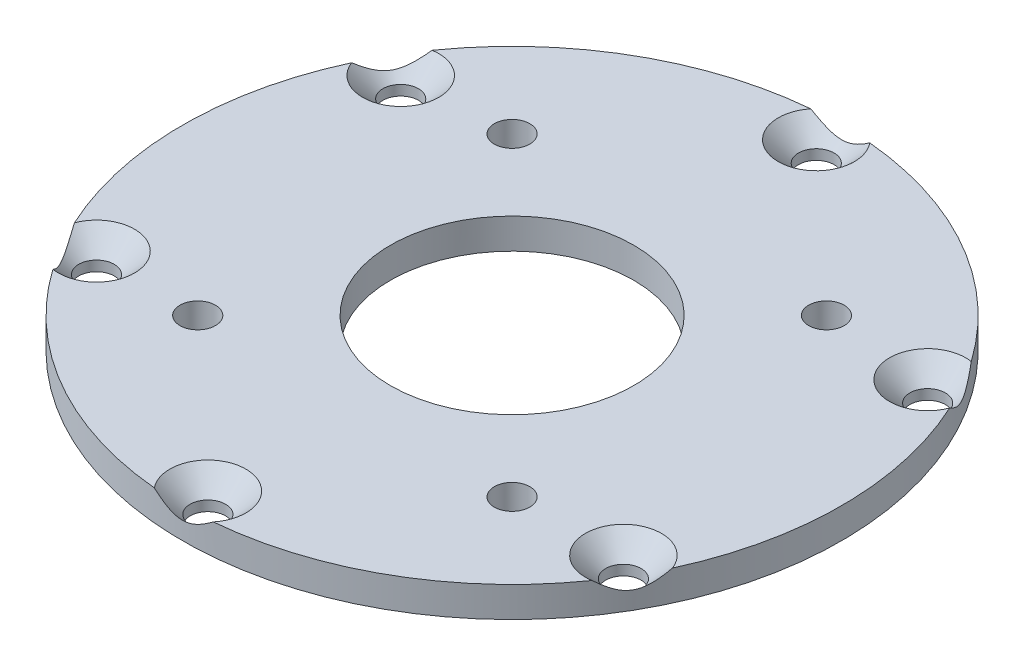
ISO-10303-21;
HEADER;
FILE_DESCRIPTION(('STEP AP214'),'2;1');
FILE_NAME('part.step','',(''),(''),'','','');
FILE_SCHEMA(('AUTOMOTIVE_DESIGN { 1 0 10303 214 1 1 1 1 }'));
ENDSEC;
DATA;
#1=APPLICATION_CONTEXT('core data for automotive mechanical design processes');
#2=APPLICATION_PROTOCOL_DEFINITION('international standard','automotive_design',2000,#1);
#3=PRODUCT_CONTEXT('',#1,'mechanical');
#4=PRODUCT('Part','Part','',(#3));
#5=PRODUCT_RELATED_PRODUCT_CATEGORY('part','',(#4));
#6=PRODUCT_DEFINITION_FORMATION('','',#4);
#7=PRODUCT_DEFINITION_CONTEXT('part definition',#1,'design');
#8=PRODUCT_DEFINITION('design','',#6,#7);
#9=PRODUCT_DEFINITION_SHAPE('','',#8);
#10=(LENGTH_UNIT() NAMED_UNIT(*) SI_UNIT(.MILLI.,.METRE.));
#11=(NAMED_UNIT(*) PLANE_ANGLE_UNIT() SI_UNIT($,.RADIAN.));
#12=(NAMED_UNIT(*) SI_UNIT($,.STERADIAN.) SOLID_ANGLE_UNIT());
#13=UNCERTAINTY_MEASURE_WITH_UNIT(LENGTH_MEASURE(1.E-05),#10,'distance_accuracy_value','');
#14=(GEOMETRIC_REPRESENTATION_CONTEXT(3) GLOBAL_UNCERTAINTY_ASSIGNED_CONTEXT((#13)) GLOBAL_UNIT_ASSIGNED_CONTEXT((#10,
#11,#12)) REPRESENTATION_CONTEXT('',''));
#15=CARTESIAN_POINT('',(0.,0.,0.));
#16=DIRECTION('',(0.,0.,1.));
#17=DIRECTION('',(1.,0.,0.));
#18=AXIS2_PLACEMENT_3D('',#15,#16,#17);
#19=CARTESIAN_POINT('',(0.,2.,0.));
#20=DIRECTION('',(0.,1.,0.));
#21=DIRECTION('',(0.,0.,1.));
#22=AXIS2_PLACEMENT_3D('',#19,#20,#21);
#23=PLANE('',#22);
#24=CARTESIAN_POINT('',(15.5,2.,15.5));
#25=DIRECTION('',(0.,1.,0.));
#26=DIRECTION('',(0.,0.,1.));
#27=AXIS2_PLACEMENT_3D('',#24,#25,#26);
#28=CIRCLE('',#27,1.75);
#29=CARTESIAN_POINT('',(15.5,2.,17.25));
#30=VERTEX_POINT('',#29);
#31=EDGE_CURVE('E152',#30,#30,#28,.T.);
#32=ORIENTED_EDGE('',*,*,#31,.F.);
#33=EDGE_LOOP('',(#32));
#34=FACE_BOUND('',#33,.T.);
#35=CARTESIAN_POINT('',(-15.5,2.,-15.5));
#36=DIRECTION('',(0.,1.,0.));
#37=DIRECTION('',(0.,0.,1.));
#38=AXIS2_PLACEMENT_3D('',#35,#36,#37);
#39=CIRCLE('',#38,1.75);
#40=CARTESIAN_POINT('',(-15.5,2.,-13.75));
#41=VERTEX_POINT('',#40);
#42=EDGE_CURVE('E125',#41,#41,#39,.T.);
#43=ORIENTED_EDGE('',*,*,#42,.F.);
#44=EDGE_LOOP('',(#43));
#45=FACE_BOUND('',#44,.T.);
#46=CARTESIAN_POINT('',(0.,2.,0.));
#47=DIRECTION('',(0.,1.,0.));
#48=DIRECTION('',(0.,0.,1.));
#49=AXIS2_PLACEMENT_3D('',#46,#47,#48);
#50=CIRCLE('',#49,32.5);
#51=CARTESIAN_POINT('',(2.90630133616557,2.,32.3697916666667));
#52=VERTEX_POINT('',#51);
#53=CARTESIAN_POINT('',(26.5799112304604,2.,18.7018266215053));
#54=VERTEX_POINT('',#53);
#55=EDGE_CURVE('E102',#52,#54,#50,.T.);
#56=ORIENTED_EDGE('',*,*,#55,.T.);
#57=CARTESIAN_POINT('',(25.9807621135332,2.,15.));
#58=DIRECTION('',(0.,1.,0.));
#59=DIRECTION('',(0.,0.,1.));
#60=AXIS2_PLACEMENT_3D('',#57,#58,#59);
#61=CIRCLE('',#60,3.75000000000003);
#62=CARTESIAN_POINT('',(29.4862125666259,2.,13.6679650451613));
#63=VERTEX_POINT('',#62);
#64=EDGE_CURVE('E284',#54,#63,#61,.F.);
#65=ORIENTED_EDGE('',*,*,#64,.T.);
#66=CARTESIAN_POINT('',(29.4862125666259,2.,-13.6679650451614));
#67=VERTEX_POINT('',#66);
#68=EDGE_CURVE('E112',#63,#67,#50,.T.);
#69=ORIENTED_EDGE('',*,*,#68,.T.);
#70=CARTESIAN_POINT('',(25.9807621135332,2.,-15.));
#71=DIRECTION('',(0.,1.,0.));
#72=DIRECTION('',(0.,0.,1.));
#73=AXIS2_PLACEMENT_3D('',#70,#71,#72);
#74=CIRCLE('',#73,3.75000000000002);
#75=CARTESIAN_POINT('',(26.5799112304604,2.,-18.7018266215053));
#76=VERTEX_POINT('',#75);
#77=EDGE_CURVE('E106',#67,#76,#74,.F.);
#78=ORIENTED_EDGE('',*,*,#77,.T.);
#79=CARTESIAN_POINT('',(2.90630133616557,2.,-32.3697916666667));
#80=VERTEX_POINT('',#79);
#81=EDGE_CURVE('E118',#76,#80,#50,.T.);
#82=ORIENTED_EDGE('',*,*,#81,.T.);
#83=CARTESIAN_POINT('',(0.,2.,-30.));
#84=DIRECTION('',(0.,1.,0.));
#85=DIRECTION('',(0.,0.,1.));
#86=AXIS2_PLACEMENT_3D('',#83,#84,#85);
#87=CIRCLE('',#86,3.75000000000002);
#88=CARTESIAN_POINT('',(-2.90630133616557,2.,-32.3697916666667));
#89=VERTEX_POINT('',#88);
#90=EDGE_CURVE('E115',#80,#89,#87,.F.);
#91=ORIENTED_EDGE('',*,*,#90,.T.);
#92=CARTESIAN_POINT('',(-26.5799112304604,2.,-18.7018266215053));
#93=VERTEX_POINT('',#92);
#94=EDGE_CURVE('E123',#89,#93,#50,.T.);
#95=ORIENTED_EDGE('',*,*,#94,.T.);
#96=CARTESIAN_POINT('',(-25.9807621135332,2.,-15.));
#97=DIRECTION('',(0.,1.,0.));
#98=DIRECTION('',(0.,0.,1.));
#99=AXIS2_PLACEMENT_3D('',#96,#97,#98);
#100=CIRCLE('',#99,3.75000000000003);
#101=CARTESIAN_POINT('',(-29.4862125666259,2.,-13.6679650451613));
#102=VERTEX_POINT('',#101);
#103=EDGE_CURVE('E111',#93,#102,#100,.F.);
#104=ORIENTED_EDGE('',*,*,#103,.T.);
#105=CARTESIAN_POINT('',(-29.4862125666259,2.,13.6679650451613));
#106=VERTEX_POINT('',#105);
#107=EDGE_CURVE('E120',#102,#106,#50,.T.);
#108=ORIENTED_EDGE('',*,*,#107,.T.);
#109=CARTESIAN_POINT('',(-25.9807621135331,2.,15.));
#110=DIRECTION('',(0.,1.,0.));
#111=DIRECTION('',(0.,0.,1.));
#112=AXIS2_PLACEMENT_3D('',#109,#110,#111);
#113=CIRCLE('',#112,3.75000000000002);
#114=CARTESIAN_POINT('',(-26.5799112304604,2.,18.7018266215054));
#115=VERTEX_POINT('',#114);
#116=EDGE_CURVE('E105',#106,#115,#113,.F.);
#117=ORIENTED_EDGE('',*,*,#116,.T.);
#118=CARTESIAN_POINT('',(-2.90630133616556,2.,32.3697916666667));
#119=VERTEX_POINT('',#118);
#120=EDGE_CURVE('E104',#115,#119,#50,.T.);
#121=ORIENTED_EDGE('',*,*,#120,.T.);
#122=CARTESIAN_POINT('',(0.,2.,30.));
#123=DIRECTION('',(0.,1.,0.));
#124=DIRECTION('',(0.,0.,1.));
#125=AXIS2_PLACEMENT_3D('',#122,#123,#124);
#126=CIRCLE('',#125,3.75000000000003);
#127=EDGE_CURVE('E95',#119,#52,#126,.F.);
#128=ORIENTED_EDGE('',*,*,#127,.T.);
#129=EDGE_LOOP('',(#56,#65,#69,#78,#82,#91,#95,#104,#108,#117,#121,#128));
#130=FACE_BOUND('',#129,.T.);
#131=CARTESIAN_POINT('',(0.,2.,0.));
#132=DIRECTION('',(0.,1.,0.));
#133=DIRECTION('',(0.,0.,1.));
#134=AXIS2_PLACEMENT_3D('',#131,#132,#133);
#135=CIRCLE('',#134,12.);
#136=CARTESIAN_POINT('',(0.,2.,12.));
#137=VERTEX_POINT('',#136);
#138=EDGE_CURVE('E121',#137,#137,#135,.T.);
#139=ORIENTED_EDGE('',*,*,#138,.F.);
#140=EDGE_LOOP('',(#139));
#141=FACE_BOUND('',#140,.T.);
#142=CARTESIAN_POINT('',(15.5,2.,-15.5));
#143=DIRECTION('',(0.,1.,0.));
#144=DIRECTION('',(0.,0.,1.));
#145=AXIS2_PLACEMENT_3D('',#142,#143,#144);
#146=CIRCLE('',#145,1.75);
#147=CARTESIAN_POINT('',(15.5,2.,-13.75));
#148=VERTEX_POINT('',#147);
#149=EDGE_CURVE('E149',#148,#148,#146,.T.);
#150=ORIENTED_EDGE('',*,*,#149,.F.);
#151=EDGE_LOOP('',(#150));
#152=FACE_BOUND('',#151,.T.);
#153=CARTESIAN_POINT('',(-15.5,2.,15.5));
#154=DIRECTION('',(0.,1.,0.));
#155=DIRECTION('',(0.,0.,1.));
#156=AXIS2_PLACEMENT_3D('',#153,#154,#155);
#157=CIRCLE('',#156,1.75);
#158=CARTESIAN_POINT('',(-15.5,2.,17.25));
#159=VERTEX_POINT('',#158);
#160=EDGE_CURVE('E155',#159,#159,#157,.T.);
#161=ORIENTED_EDGE('',*,*,#160,.F.);
#162=EDGE_LOOP('',(#161));
#163=FACE_BOUND('',#162,.T.);
#164=ADVANCED_FACE('F35',(#34,#45,#130,#141,#152,#163),#23,.T.);
#165=CARTESIAN_POINT('',(0.,2.,0.));
#166=DIRECTION('',(0.,-1.,0.));
#167=DIRECTION('',(0.,0.,-1.));
#168=AXIS2_PLACEMENT_3D('',#165,#166,#167);
#169=CYLINDRICAL_SURFACE('',#168,32.5);
#170=ORIENTED_EDGE('',*,*,#68,.F.);
#171=CARTESIAN_POINT('',(29.4862125666259,2.,13.6679650451613));
#172=CARTESIAN_POINT('',(29.4555234860294,1.94780868009385,13.7341695994241));
#173=CARTESIAN_POINT('',(29.4244428512231,1.89617255705345,13.8006378150768));
#174=CARTESIAN_POINT('',(29.3614136432464,1.79425995466768,13.9342333082718));
#175=CARTESIAN_POINT('',(29.3294648376037,1.74398384683377,14.0013607592042));
#176=CARTESIAN_POINT('',(29.2643758479787,1.644679801251,14.1369020516541));
#177=CARTESIAN_POINT('',(29.2312282665162,1.5956648009695,14.2053218594469));
#178=CARTESIAN_POINT('',(29.1638910986025,1.4996627352676,14.3430587309598));
#179=CARTESIAN_POINT('',(29.1297015877594,1.4526755232949,14.4123757293658));
#180=CARTESIAN_POINT('',(29.0584297905365,1.35888372518424,14.555561404181));
#181=CARTESIAN_POINT('',(29.0212883270272,1.31220562569459,14.6294844269062));
#182=CARTESIAN_POINT('',(28.9456035525854,1.2222557303936,14.7786682831791));
#183=CARTESIAN_POINT('',(28.9070600066293,1.17898450954181,14.8539293399234));
#184=CARTESIAN_POINT('',(28.7893344039557,1.0557587554973,15.0815561795725));
#185=CARTESIAN_POINT('',(28.7077898136554,0.982025597770912,15.2363047184965));
#186=CARTESIAN_POINT('',(28.5798206982912,0.890595254154731,15.4742395811237));
#187=CARTESIAN_POINT('',(28.5359204566654,0.863200157714715,15.5550603445617));
#188=CARTESIAN_POINT('',(28.4464164462979,0.816530341851256,15.7181435380461));
#189=CARTESIAN_POINT('',(28.4008127118511,0.797255459046619,15.8004059390517));
#190=CARTESIAN_POINT('',(28.3089933157821,0.768357971485999,15.9643214073323));
#191=CARTESIAN_POINT('',(28.2628033695141,0.758568168918176,16.045958867777));
#192=CARTESIAN_POINT('',(28.1694575096612,0.748781772757009,16.2092722128646));
#193=CARTESIAN_POINT('',(28.1223016963515,0.748784167651301,16.2909480926671));
#194=CARTESIAN_POINT('',(28.0275238762613,0.758581730041967,16.4534726255175));
#195=CARTESIAN_POINT('',(27.9799016703953,0.768381277660284,16.5343208922224));
#196=CARTESIAN_POINT('',(27.8846858038437,0.797044548434376,16.6943996118302));
#197=CARTESIAN_POINT('',(27.8370921512847,0.81591018059917,16.7736297203396));
#198=CARTESIAN_POINT('',(27.7414303008804,0.861906769798528,16.9313824429345));
#199=CARTESIAN_POINT('',(27.6933688121217,0.889179346744546,17.009867139545));
#200=CARTESIAN_POINT('',(27.5978105437385,0.95045679901899,17.164472436222));
#201=CARTESIAN_POINT('',(27.5503137654179,0.984461689888949,17.2405930308305));
#202=CARTESIAN_POINT('',(27.4218654701576,1.08436069771775,17.4446143501673));
#203=CARTESIAN_POINT('',(27.3414916832396,1.15556598082941,17.5702649939731));
#204=CARTESIAN_POINT('',(27.1821244554929,1.30885083223663,17.8158238439445));
#205=CARTESIAN_POINT('',(27.1031334404471,1.39094769166072,17.9357224975055));
#206=CARTESIAN_POINT('',(26.9497127566355,1.55863328886575,18.1653835894573));
#207=CARTESIAN_POINT('',(26.8752390900742,1.64389313378364,18.2753590018183));
#208=CARTESIAN_POINT('',(26.7640705869731,1.77521508635934,18.4374290324791));
#209=CARTESIAN_POINT('',(26.7271758920009,1.81947183191165,18.4908691835287));
#210=CARTESIAN_POINT('',(26.6534829954802,1.90900784976892,18.5969355067302));
#211=CARTESIAN_POINT('',(26.6166847794615,1.95428695763216,18.6495618075236));
#212=CARTESIAN_POINT('',(26.5799112304604,1.99999999999998,18.7018266215053));
#213=B_SPLINE_CURVE_WITH_KNOTS('',3,(#171,#172,#173,#174,#175,#176,#177,#178,#179,#180,#181,
#182,#183,#184,#185,#186,#187,#188,#189,#190,#191,#192,#193,#194,#195,#196,#197,#198,#199,#200,
#201,#202,#203,#204,#205,#206,#207,#208,#209,#210,#211,#212),.UNSPECIFIED.,.F.,.F.,(4,2,2,2,2,2,
2,2,2,2,2,2,2,2,2,2,2,2,2,2,4),(0.,0.26915038112179,0.538373557648982,0.809715576349393,
1.0810379516681,1.36592018158062,1.65085038684979,2.21860263215552,2.5062131716175,
2.79381792399063,3.07625536149496,3.35866362383673,3.64119820206599,3.92379229855178,
4.21143423143784,4.49907682835249,4.99417395187336,5.49006669815813,5.96339400066092,
6.19914359911623,6.4348555448431),.UNSPECIFIED.);
#214=EDGE_CURVE('E11',#63,#54,#213,.T.);
#215=ORIENTED_EDGE('',*,*,#214,.T.);
#216=ORIENTED_EDGE('',*,*,#55,.F.);
#217=CARTESIAN_POINT('',(2.90630133616557,2.,32.3697916666667));
#218=CARTESIAN_POINT('',(2.83362197002955,1.94780868009387,32.3763164203827));
#219=CARTESIAN_POINT('',(2.76051848932696,1.89617255705349,32.3826339089011));
#220=CARTESIAN_POINT('',(2.61330679440062,1.79425995466772,32.3948467602103));
#221=CARTESIAN_POINT('',(2.53919831378049,1.74398384683381,32.4007420083693));
#222=CARTESIAN_POINT('',(2.38927161644457,1.64467980125103,32.4121439360724));
#223=CARTESIAN_POINT('',(2.31344453404271,1.59566480096953,32.4176471923482));
#224=CARTESIAN_POINT('',(2.16049232031794,1.49966273526763,32.4281999300725));
#225=CARTESIAN_POINT('',(2.08336728336265,1.45267552329494,32.4332494443424));
#226=CARTESIAN_POINT('',(1.92372895290328,1.35888372518428,32.4431190947817));
#227=CARTESIAN_POINT('',(1.84113900554407,1.31220562569462,32.4479151552114));
#228=CARTESIAN_POINT('',(1.67409960895625,1.22225573039362,32.4569621460016));
#229=CARTESIAN_POINT('',(1.58964984892202,1.17898450954183,32.4612129844238));
#230=CARTESIAN_POINT('',(1.3336564218659,1.05575875549732,32.4730730416572));
#231=CARTESIAN_POINT('',(1.15886796080904,0.982025597770939,32.479827624378));
#232=CARTESIAN_POINT('',(0.888825767645892,0.890595254154754,32.4879705508863));
#233=CARTESIAN_POINT('',(0.796882812542426,0.863200157714736,32.4903622081251));
#234=CARTESIAN_POINT('',(0.610896618870828,0.816530341851271,32.4943910581485));
#235=CARTESIAN_POINT('',(0.516853422600287,0.797255459046629,32.496028266113));
#236=CARTESIAN_POINT('',(0.328988764961612,0.768357971486004,32.4984680706974));
#237=CARTESIAN_POINT('',(0.235193677181968,0.75856816891818,32.4992851340521));
#238=CARTESIAN_POINT('',(0.0470872416326969,0.748781772757013,32.5001019206252));
#239=CARTESIAN_POINT('',(-0.0472240518075802,0.748784167651307,32.5001017282641));
#240=CARTESIAN_POINT('',(-0.235363336039318,0.75858173004197,32.499283994776));
#241=CARTESIAN_POINT('',(-0.329191091790666,0.768381277660283,32.4984660880641));
#242=CARTESIAN_POINT('',(-0.515431262852179,0.797044548434372,32.4960460885911));
#243=CARTESIAN_POINT('',(-0.607843375845334,0.815910180599167,32.4944438306707));
#244=CARTESIAN_POINT('',(-0.792292166330881,0.861906769798525,32.490474599345));
#245=CARTESIAN_POINT('',(-0.884292651783258,0.889179346744541,32.4880944774416));
#246=CARTESIAN_POINT('',(-1.06596390045675,0.950456799018979,32.4826412378186));
#247=CARTESIAN_POINT('',(-1.15563465829914,0.984461689888934,32.4795681184992));
#248=CARTESIAN_POINT('',(-1.39654645138867,1.08436069771773,32.4703392913994));
#249=CARTESIAN_POINT('',(-1.5455499943853,1.15556598082941,32.463558872033));
#250=CARTESIAN_POINT('',(-1.837893810458,1.30885083223664,32.4483222292593));
#251=CARTESIAN_POINT('',(-1.98122459784432,1.39094769166073,32.4398633303395));
#252=CARTESIAN_POINT('',(-2.25682727964125,1.55863328886577,32.4218276666685));
#253=CARTESIAN_POINT('',(-2.38930561381823,1.64389313378366,32.412319285694));
#254=CARTESIAN_POINT('',(-2.58524662911313,1.77521508635937,32.3970795532382));
#255=CARTESIAN_POINT('',(-2.64997450499026,1.81947183191168,32.3918478856521));
#256=CARTESIAN_POINT('',(-2.77867708362915,1.90900784976896,32.3810611267875));
#257=CARTESIAN_POINT('',(-2.84265190503276,1.95428695763221,32.375506087298));
#258=CARTESIAN_POINT('',(-2.90630133616555,2.00000000000003,32.3697916666667));
#259=B_SPLINE_CURVE_WITH_KNOTS('',3,(#217,#218,#219,#220,#221,#222,#223,#224,#225,#226,#227,
#228,#229,#230,#231,#232,#233,#234,#235,#236,#237,#238,#239,#240,#241,#242,#243,#244,#245,#246,
#247,#248,#249,#250,#251,#252,#253,#254,#255,#256,#257,#258),.UNSPECIFIED.,.F.,.F.,(4,2,2,2,2,2,
2,2,2,2,2,2,2,2,2,2,2,2,2,2,4),(0.,0.269150381121789,0.538373557648982,0.809715576349392,
1.08103795166809,1.36592018158061,1.65085038684978,2.21860263215552,2.50621317161751,
2.79381792399063,3.07625536149497,3.35866362383674,3.64119820206601,3.9237922985518,
4.21143423143786,4.49907682835252,4.99417395187341,5.4900666981582,5.96339400066103,
6.19914359911635,6.43485554484324),.UNSPECIFIED.);
#260=EDGE_CURVE('E56',#52,#119,#259,.T.);
#261=ORIENTED_EDGE('',*,*,#260,.T.);
#262=ORIENTED_EDGE('',*,*,#120,.F.);
#263=CARTESIAN_POINT('',(-26.5799112304604,2.,18.7018266215054));
#264=CARTESIAN_POINT('',(-26.6219015159998,1.94780868009387,18.6421468209586));
#265=CARTESIAN_POINT('',(-26.6639243618962,1.89617255705349,18.5819960938243));
#266=CARTESIAN_POINT('',(-26.7481068488458,1.79425995466773,18.4606134519386));
#267=CARTESIAN_POINT('',(-26.7902665238232,1.74398384683382,18.3993812491652));
#268=CARTESIAN_POINT('',(-26.8751042315341,1.64467980125105,18.2752418844183));
#269=CARTESIAN_POINT('',(-26.9177837324735,1.59566480096954,18.2123253329014));
#270=CARTESIAN_POINT('',(-27.0033987782845,1.49966273526764,18.0851411991128));
#271=CARTESIAN_POINT('',(-27.0463343043967,1.45267552329495,18.0208737149766));
#272=CARTESIAN_POINT('',(-27.1347008376333,1.35888372518429,17.8875576906007));
#273=CARTESIAN_POINT('',(-27.1801493214832,1.31220562569463,17.8184307283053));
#274=CARTESIAN_POINT('',(-27.2715039436292,1.22225573039364,17.6782938628225));
#275=CARTESIAN_POINT('',(-27.3174101577073,1.17898450954185,17.6072836445005));
#276=CARTESIAN_POINT('',(-27.4556779820898,1.05575875549734,17.3915168620847));
#277=CARTESIAN_POINT('',(-27.5489218528464,0.982025597770954,17.2435229058815));
#278=CARTESIAN_POINT('',(-27.6909949306453,0.890595254154767,17.0137309697627));
#279=CARTESIAN_POINT('',(-27.739037644123,0.863200157714749,16.9353018635635));
#280=CARTESIAN_POINT('',(-27.8355198274271,0.816530341851285,16.7762475201024));
#281=CARTESIAN_POINT('',(-27.8839592892509,0.797255459046646,16.6956223270613));
#282=CARTESIAN_POINT('',(-27.9800045508205,0.76835797148602,16.5341466633651));
#283=CARTESIAN_POINT('',(-28.0276096923321,0.758568168918192,16.4533262662751));
#284=CARTESIAN_POINT('',(-28.1223702680285,0.748781772757021,16.2908297077607));
#285=CARTESIAN_POINT('',(-28.1695257481591,0.748784167651314,16.2091536355971));
#286=CARTESIAN_POINT('',(-28.2628872123006,0.758581730041981,16.0458113692585));
#287=CARTESIAN_POINT('',(-28.309092762186,0.768381277660299,15.9641451958418));
#288=CARTESIAN_POINT('',(-28.4001170666959,0.797044548434388,15.8016464767609));
#289=CARTESIAN_POINT('',(-28.44493552713,0.815910180599177,15.7208141103312));
#290=CARTESIAN_POINT('',(-28.5337224672112,0.861906769798532,15.5590921564106));
#291=CARTESIAN_POINT('',(-28.5776614639049,0.889179346744551,15.4782273378966));
#292=CARTESIAN_POINT('',(-28.6637744441952,0.950456799018992,15.3181688015966));
#293=CARTESIAN_POINT('',(-28.7059484237171,0.984461689888948,15.2389750876688));
#294=CARTESIAN_POINT('',(-28.8184119215462,1.08436069771775,15.0257249412321));
#295=CARTESIAN_POINT('',(-28.8870416776249,1.15556598082942,14.8932938780599));
#296=CARTESIAN_POINT('',(-29.0200182659509,1.30885083223665,14.6324983853149));
#297=CARTESIAN_POINT('',(-29.0843580382914,1.39094769166074,14.504140832834));
#298=CARTESIAN_POINT('',(-29.2065400362767,1.55863328886578,14.2564440772112));
#299=CARTESIAN_POINT('',(-29.2645447038924,1.64389313378367,14.1369602838757));
#300=CARTESIAN_POINT('',(-29.3493172160862,1.77521508635938,13.959650520759));
#301=CARTESIAN_POINT('',(-29.3771503969911,1.81947183191169,13.9009787021234));
#302=CARTESIAN_POINT('',(-29.4321600791093,1.90900784976897,13.7841256200573));
#303=CARTESIAN_POINT('',(-29.4593366844942,1.95428695763221,13.7259442797744));
#304=CARTESIAN_POINT('',(-29.4862125666259,2.00000000000004,13.6679650451613));
#305=B_SPLINE_CURVE_WITH_KNOTS('',3,(#263,#264,#265,#266,#267,#268,#269,#270,#271,#272,#273,
#274,#275,#276,#277,#278,#279,#280,#281,#282,#283,#284,#285,#286,#287,#288,#289,#290,#291,#292,
#293,#294,#295,#296,#297,#298,#299,#300,#301,#302,#303,#304),.UNSPECIFIED.,.F.,.F.,(4,2,2,2,2,2,
2,2,2,2,2,2,2,2,2,2,2,2,2,2,4),(0.,0.269150381121787,0.538373557648977,0.809715576349388,
1.08103795166809,1.36592018158061,1.65085038684978,2.21860263215551,2.50621317161749,
2.79381792399062,3.07625536149495,3.35866362383672,3.64119820206599,3.92379229855178,
4.21143423143784,4.4990768283525,4.9941739518734,5.49006669815819,5.96339400066101,
6.19914359911634,6.43485554484322),.UNSPECIFIED.);
#306=EDGE_CURVE('E49',#115,#106,#305,.T.);
#307=ORIENTED_EDGE('',*,*,#306,.T.);
#308=ORIENTED_EDGE('',*,*,#107,.F.);
#309=CARTESIAN_POINT('',(-29.4862125666259,2.,-13.6679650451613));
#310=CARTESIAN_POINT('',(-29.4555234860294,1.94780868009385,-13.7341695994241));
#311=CARTESIAN_POINT('',(-29.4244428512231,1.89617255705345,-13.8006378150768));
#312=CARTESIAN_POINT('',(-29.3614136432464,1.79425995466768,-13.9342333082718));
#313=CARTESIAN_POINT('',(-29.3294648376037,1.74398384683377,-14.0013607592042));
#314=CARTESIAN_POINT('',(-29.2643758479787,1.644679801251,-14.1369020516541));
#315=CARTESIAN_POINT('',(-29.2312282665162,1.5956648009695,-14.2053218594469));
#316=CARTESIAN_POINT('',(-29.1638910986025,1.4996627352676,-14.3430587309598));
#317=CARTESIAN_POINT('',(-29.1297015877594,1.4526755232949,-14.4123757293658));
#318=CARTESIAN_POINT('',(-29.0584297905365,1.35888372518424,-14.555561404181));
#319=CARTESIAN_POINT('',(-29.0212883270272,1.31220562569459,-14.6294844269062));
#320=CARTESIAN_POINT('',(-28.9456035525854,1.2222557303936,-14.7786682831791));
#321=CARTESIAN_POINT('',(-28.9070600066293,1.17898450954181,-14.8539293399234));
#322=CARTESIAN_POINT('',(-28.7893344039557,1.0557587554973,-15.0815561795725));
#323=CARTESIAN_POINT('',(-28.7077898136554,0.982025597770912,-15.2363047184965));
#324=CARTESIAN_POINT('',(-28.5798206982912,0.890595254154731,-15.4742395811237));
#325=CARTESIAN_POINT('',(-28.5359204566654,0.863200157714715,-15.5550603445617));
#326=CARTESIAN_POINT('',(-28.4464164462979,0.816530341851256,-15.7181435380461));
#327=CARTESIAN_POINT('',(-28.4008127118511,0.797255459046619,-15.8004059390517));
#328=CARTESIAN_POINT('',(-28.3089933157821,0.768357971485999,-15.9643214073323));
#329=CARTESIAN_POINT('',(-28.2628033695141,0.758568168918176,-16.045958867777));
#330=CARTESIAN_POINT('',(-28.1694575096612,0.748781772757009,-16.2092722128646));
#331=CARTESIAN_POINT('',(-28.1223016963515,0.748784167651301,-16.2909480926671));
#332=CARTESIAN_POINT('',(-28.0275238762613,0.758581730041967,-16.4534726255175));
#333=CARTESIAN_POINT('',(-27.9799016703953,0.768381277660284,-16.5343208922224));
#334=CARTESIAN_POINT('',(-27.8846858038437,0.797044548434376,-16.6943996118302));
#335=CARTESIAN_POINT('',(-27.8370921512847,0.81591018059917,-16.7736297203396));
#336=CARTESIAN_POINT('',(-27.7414303008804,0.861906769798528,-16.9313824429345));
#337=CARTESIAN_POINT('',(-27.6933688121217,0.889179346744546,-17.009867139545));
#338=CARTESIAN_POINT('',(-27.5978105437385,0.95045679901899,-17.164472436222));
#339=CARTESIAN_POINT('',(-27.5503137654179,0.984461689888949,-17.2405930308305));
#340=CARTESIAN_POINT('',(-27.4218654701576,1.08436069771775,-17.4446143501673));
#341=CARTESIAN_POINT('',(-27.3414916832396,1.15556598082941,-17.5702649939731));
#342=CARTESIAN_POINT('',(-27.1821244554929,1.30885083223663,-17.8158238439445));
#343=CARTESIAN_POINT('',(-27.1031334404471,1.39094769166072,-17.9357224975055));
#344=CARTESIAN_POINT('',(-26.9497127566355,1.55863328886575,-18.1653835894573));
#345=CARTESIAN_POINT('',(-26.8752390900742,1.64389313378364,-18.2753590018183));
#346=CARTESIAN_POINT('',(-26.7640705869731,1.77521508635934,-18.4374290324791));
#347=CARTESIAN_POINT('',(-26.7271758920009,1.81947183191165,-18.4908691835287));
#348=CARTESIAN_POINT('',(-26.6534829954802,1.90900784976892,-18.5969355067302));
#349=CARTESIAN_POINT('',(-26.6166847794615,1.95428695763216,-18.6495618075236));
#350=CARTESIAN_POINT('',(-26.5799112304604,1.99999999999998,-18.7018266215053));
#351=B_SPLINE_CURVE_WITH_KNOTS('',3,(#309,#310,#311,#312,#313,#314,#315,#316,#317,#318,#319,
#320,#321,#322,#323,#324,#325,#326,#327,#328,#329,#330,#331,#332,#333,#334,#335,#336,#337,#338,
#339,#340,#341,#342,#343,#344,#345,#346,#347,#348,#349,#350),.UNSPECIFIED.,.F.,.F.,(4,2,2,2,2,2,
2,2,2,2,2,2,2,2,2,2,2,2,2,2,4),(0.,0.26915038112179,0.538373557648982,0.809715576349393,
1.0810379516681,1.36592018158062,1.65085038684979,2.21860263215552,2.5062131716175,
2.79381792399063,3.07625536149496,3.35866362383673,3.64119820206599,3.92379229855178,
4.21143423143784,4.49907682835249,4.99417395187336,5.49006669815813,5.96339400066092,
6.19914359911623,6.4348555448431),.UNSPECIFIED.);
#352=EDGE_CURVE('E232',#102,#93,#351,.T.);
#353=ORIENTED_EDGE('',*,*,#352,.T.);
#354=ORIENTED_EDGE('',*,*,#94,.F.);
#355=CARTESIAN_POINT('',(-2.90630133616557,2.,-32.3697916666667));
#356=CARTESIAN_POINT('',(-2.83362197002954,1.94780868009388,-32.3763164203827));
#357=CARTESIAN_POINT('',(-2.76051848932695,1.8961725570535,-32.3826339089011));
#358=CARTESIAN_POINT('',(-2.61330679440061,1.79425995466773,-32.3948467602103));
#359=CARTESIAN_POINT('',(-2.53919831378049,1.74398384683381,-32.4007420083693));
#360=CARTESIAN_POINT('',(-2.38927161644457,1.64467980125104,-32.4121439360724));
#361=CARTESIAN_POINT('',(-2.31344453404271,1.59566480096954,-32.4176471923482));
#362=CARTESIAN_POINT('',(-2.16049232031794,1.49966273526764,-32.4281999300725));
#363=CARTESIAN_POINT('',(-2.08336728336264,1.45267552329494,-32.4332494443424));
#364=CARTESIAN_POINT('',(-1.92372895290328,1.35888372518428,-32.4431190947817));
#365=CARTESIAN_POINT('',(-1.84113900554407,1.31220562569462,-32.4479151552114));
#366=CARTESIAN_POINT('',(-1.67409960895625,1.22225573039363,-32.4569621460016));
#367=CARTESIAN_POINT('',(-1.58964984892201,1.17898450954184,-32.4612129844238));
#368=CARTESIAN_POINT('',(-1.3336564218659,1.05575875549733,-32.4730730416572));
#369=CARTESIAN_POINT('',(-1.15886796080903,0.982025597770939,-32.479827624378));
#370=CARTESIAN_POINT('',(-0.888825767645891,0.890595254154754,-32.4879705508863));
#371=CARTESIAN_POINT('',(-0.796882812542427,0.863200157714736,-32.4903622081251));
#372=CARTESIAN_POINT('',(-0.610896618870831,0.81653034185127,-32.4943910581485));
#373=CARTESIAN_POINT('',(-0.516853422600291,0.797255459046628,-32.496028266113));
#374=CARTESIAN_POINT('',(-0.328988764961619,0.768357971486002,-32.4984680706974));
#375=CARTESIAN_POINT('',(-0.235193677181976,0.758568168918178,-32.4992851340521));
#376=CARTESIAN_POINT('',(-0.0470872416327078,0.74878177275701,-32.5001019206252));
#377=CARTESIAN_POINT('',(0.047224051807568,0.748784167651303,-32.5001017282641));
#378=CARTESIAN_POINT('',(0.235363336039303,0.758581730041965,-32.499283994776));
#379=CARTESIAN_POINT('',(0.32919109179065,0.768381277660278,-32.4984660880641));
#380=CARTESIAN_POINT('',(0.515431262852161,0.797044548434366,-32.4960460885911));
#381=CARTESIAN_POINT('',(0.607843375845314,0.815910180599159,-32.4944438306707));
#382=CARTESIAN_POINT('',(0.79229216633086,0.861906769798515,-32.490474599345));
#383=CARTESIAN_POINT('',(0.884292651783236,0.88917934674453,-32.4880944774416));
#384=CARTESIAN_POINT('',(1.06596390045672,0.950456799018969,-32.4826412378186));
#385=CARTESIAN_POINT('',(1.15563465829912,0.984461689888927,-32.4795681184993));
#386=CARTESIAN_POINT('',(1.39654645138864,1.08436069771773,-32.4703392913994));
#387=CARTESIAN_POINT('',(1.54554999438528,1.1555659808294,-32.463558872033));
#388=CARTESIAN_POINT('',(1.83789381045799,1.30885083223663,-32.4483222292593));
#389=CARTESIAN_POINT('',(1.98122459784431,1.39094769166073,-32.4398633303395));
#390=CARTESIAN_POINT('',(2.25682727964125,1.55863328886577,-32.4218276666685));
#391=CARTESIAN_POINT('',(2.38930561381822,1.64389313378366,-32.412319285694));
#392=CARTESIAN_POINT('',(2.58524662911313,1.77521508635937,-32.3970795532382));
#393=CARTESIAN_POINT('',(2.64997450499026,1.81947183191169,-32.3918478856521));
#394=CARTESIAN_POINT('',(2.77867708362915,1.90900784976897,-32.3810611267875));
#395=CARTESIAN_POINT('',(2.84265190503276,1.95428695763221,-32.375506087298));
#396=CARTESIAN_POINT('',(2.90630133616555,2.00000000000004,-32.3697916666667));
#397=B_SPLINE_CURVE_WITH_KNOTS('',3,(#355,#356,#357,#358,#359,#360,#361,#362,#363,#364,#365,
#366,#367,#368,#369,#370,#371,#372,#373,#374,#375,#376,#377,#378,#379,#380,#381,#382,#383,#384,
#385,#386,#387,#388,#389,#390,#391,#392,#393,#394,#395,#396),.UNSPECIFIED.,.F.,.F.,(4,2,2,2,2,2,
2,2,2,2,2,2,2,2,2,2,2,2,2,2,4),(0.,0.269150381121788,0.53837355764898,0.809715576349389,
1.08103795166809,1.36592018158061,1.65085038684978,2.21860263215551,2.5062131716175,
2.79381792399062,3.07625536149495,3.35866362383672,3.64119820206598,3.92379229855177,
4.21143423143783,4.49907682835248,4.99417395187339,5.49006669815819,5.96339400066102,
6.19914359911635,6.43485554484324),.UNSPECIFIED.);
#398=EDGE_CURVE('E240',#89,#80,#397,.T.);
#399=ORIENTED_EDGE('',*,*,#398,.T.);
#400=ORIENTED_EDGE('',*,*,#81,.F.);
#401=CARTESIAN_POINT('',(26.5799112304604,2.,-18.7018266215053));
#402=CARTESIAN_POINT('',(26.6219015159999,1.94780868009385,-18.6421468209586));
#403=CARTESIAN_POINT('',(26.6639243618962,1.89617255705346,-18.5819960938243));
#404=CARTESIAN_POINT('',(26.7481068488459,1.79425995466769,-18.4606134519385));
#405=CARTESIAN_POINT('',(26.7902665238233,1.74398384683378,-18.3993812491652));
#406=CARTESIAN_POINT('',(26.8751042315341,1.64467980125101,-18.2752418844183));
#407=CARTESIAN_POINT('',(26.9177837324735,1.5956648009695,-18.2123253329013));
#408=CARTESIAN_POINT('',(27.0033987782846,1.4996627352676,-18.0851411991127));
#409=CARTESIAN_POINT('',(27.0463343043968,1.45267552329491,-18.0208737149766));
#410=CARTESIAN_POINT('',(27.1347008376333,1.35888372518425,-17.8875576906007));
#411=CARTESIAN_POINT('',(27.1801493214832,1.3122056256946,-17.8184307283053));
#412=CARTESIAN_POINT('',(27.2715039436292,1.22225573039361,-17.6782938628225));
#413=CARTESIAN_POINT('',(27.3174101577073,1.17898450954182,-17.6072836445004));
#414=CARTESIAN_POINT('',(27.4556779820898,1.05575875549731,-17.3915168620847));
#415=CARTESIAN_POINT('',(27.5489218528464,0.982025597770921,-17.2435229058814));
#416=CARTESIAN_POINT('',(27.6909949306454,0.890595254154744,-17.0137309697627));
#417=CARTESIAN_POINT('',(27.739037644123,0.86320015771473,-16.9353018635635));
#418=CARTESIAN_POINT('',(27.8355198274271,0.816530341851269,-16.7762475201024));
#419=CARTESIAN_POINT('',(27.8839592892509,0.797255459046628,-16.6956223270612));
#420=CARTESIAN_POINT('',(27.9800045508206,0.768357971486007,-16.5341466633651));
#421=CARTESIAN_POINT('',(28.0276096923321,0.758568168918187,-16.4533262662751));
#422=CARTESIAN_POINT('',(28.1223702680285,0.748781772757022,-16.2908297077606));
#423=CARTESIAN_POINT('',(28.1695257481591,0.748784167651314,-16.209153635597));
#424=CARTESIAN_POINT('',(28.2628872123007,0.75858173004198,-16.0458113692584));
#425=CARTESIAN_POINT('',(28.309092762186,0.768381277660299,-15.9641451958418));
#426=CARTESIAN_POINT('',(28.4001170666959,0.79704454843439,-15.8016464767608));
#427=CARTESIAN_POINT('',(28.4449355271301,0.815910180599181,-15.7208141103312));
#428=CARTESIAN_POINT('',(28.5337224672113,0.861906769798541,-15.5590921564105));
#429=CARTESIAN_POINT('',(28.577661463905,0.889179346744562,-15.4782273378966));
#430=CARTESIAN_POINT('',(28.6637744441953,0.950456799019007,-15.3181688015966));
#431=CARTESIAN_POINT('',(28.7059484237171,0.984461689888963,-15.2389750876688));
#432=CARTESIAN_POINT('',(28.8184119215462,1.08436069771776,-15.0257249412321));
#433=CARTESIAN_POINT('',(28.8870416776249,1.15556598082942,-14.8932938780599));
#434=CARTESIAN_POINT('',(29.0200182659509,1.30885083223664,-14.6324983853149));
#435=CARTESIAN_POINT('',(29.0843580382914,1.39094769166074,-14.504140832834));
#436=CARTESIAN_POINT('',(29.2065400362767,1.55863328886576,-14.2564440772112));
#437=CARTESIAN_POINT('',(29.2645447038924,1.64389313378365,-14.1369602838757));
#438=CARTESIAN_POINT('',(29.3493172160862,1.77521508635935,-13.9596505207591));
#439=CARTESIAN_POINT('',(29.3771503969911,1.81947183191166,-13.9009787021234));
#440=CARTESIAN_POINT('',(29.4321600791093,1.90900784976893,-13.7841256200573));
#441=CARTESIAN_POINT('',(29.4593366844942,1.95428695763217,-13.7259442797745));
#442=CARTESIAN_POINT('',(29.4862125666259,2.,-13.6679650451614));
#443=B_SPLINE_CURVE_WITH_KNOTS('',3,(#401,#402,#403,#404,#405,#406,#407,#408,#409,#410,#411,
#412,#413,#414,#415,#416,#417,#418,#419,#420,#421,#422,#423,#424,#425,#426,#427,#428,#429,#430,
#431,#432,#433,#434,#435,#436,#437,#438,#439,#440,#441,#442),.UNSPECIFIED.,.F.,.F.,(4,2,2,2,2,2,
2,2,2,2,2,2,2,2,2,2,2,2,2,2,4),(0.,0.26915038112179,0.53837355764898,0.80971557634939,
1.08103795166809,1.36592018158061,1.65085038684978,2.21860263215551,2.5062131716175,
2.79381792399062,3.07625536149495,3.35866362383672,3.64119820206598,3.92379229855177,
4.21143423143783,4.49907682835248,4.99417395187335,5.49006669815811,5.96339400066091,
6.19914359911622,6.43485554484309),.UNSPECIFIED.);
#444=EDGE_CURVE('E96',#76,#67,#443,.T.);
#445=ORIENTED_EDGE('',*,*,#444,.T.);
#446=EDGE_LOOP('',(#170,#215,#216,#261,#262,#307,#308,#353,#354,#399,#400,#445));
#447=FACE_BOUND('',#446,.T.);
#448=CARTESIAN_POINT('',(0.,-1.,0.));
#449=DIRECTION('',(0.,-1.,0.));
#450=DIRECTION('',(0.,0.,-1.));
#451=AXIS2_PLACEMENT_3D('',#448,#449,#450);
#452=CIRCLE('',#451,32.5);
#453=CARTESIAN_POINT('',(0.,-1.,-32.5));
#454=VERTEX_POINT('',#453);
#455=EDGE_CURVE('E158',#454,#454,#452,.T.);
#456=ORIENTED_EDGE('',*,*,#455,.F.);
#457=EDGE_LOOP('',(#456));
#458=FACE_BOUND('',#457,.T.);
#459=ADVANCED_FACE('F109',(#447,#458),#169,.T.);
#460=CARTESIAN_POINT('',(0.,2.,0.));
#461=DIRECTION('',(0.,-1.,0.));
#462=DIRECTION('',(0.,0.,-1.));
#463=AXIS2_PLACEMENT_3D('',#460,#461,#462);
#464=CYLINDRICAL_SURFACE('',#463,12.);
#465=ORIENTED_EDGE('',*,*,#138,.T.);
#466=EDGE_LOOP('',(#465));
#467=FACE_BOUND('',#466,.T.);
#468=CARTESIAN_POINT('',(0.,-1.,0.));
#469=DIRECTION('',(0.,-1.,0.));
#470=DIRECTION('',(0.,0.,-1.));
#471=AXIS2_PLACEMENT_3D('',#468,#469,#470);
#472=CIRCLE('',#471,12.);
#473=CARTESIAN_POINT('',(0.,-1.,-12.));
#474=VERTEX_POINT('',#473);
#475=EDGE_CURVE('E161',#474,#474,#472,.T.);
#476=ORIENTED_EDGE('',*,*,#475,.T.);
#477=EDGE_LOOP('',(#476));
#478=FACE_BOUND('',#477,.T.);
#479=ADVANCED_FACE('F220',(#467,#478),#464,.F.);
#480=CARTESIAN_POINT('',(-15.5,2.,-15.5));
#481=DIRECTION('',(0.,-1.,0.));
#482=DIRECTION('',(0.,0.,-1.));
#483=AXIS2_PLACEMENT_3D('',#480,#481,#482);
#484=CYLINDRICAL_SURFACE('',#483,1.75);
#485=ORIENTED_EDGE('',*,*,#42,.T.);
#486=EDGE_LOOP('',(#485));
#487=FACE_BOUND('',#486,.T.);
#488=CARTESIAN_POINT('',(-15.5,-1.,-15.5));
#489=DIRECTION('',(0.,-1.,0.));
#490=DIRECTION('',(0.,0.,-1.));
#491=AXIS2_PLACEMENT_3D('',#488,#489,#490);
#492=CIRCLE('',#491,1.75);
#493=CARTESIAN_POINT('',(-15.5,-1.,-17.25));
#494=VERTEX_POINT('',#493);
#495=EDGE_CURVE('E164',#494,#494,#492,.T.);
#496=ORIENTED_EDGE('',*,*,#495,.T.);
#497=EDGE_LOOP('',(#496));
#498=FACE_BOUND('',#497,.T.);
#499=ADVANCED_FACE('F340',(#487,#498),#484,.F.);
#500=CARTESIAN_POINT('',(15.5,2.,-15.5));
#501=DIRECTION('',(0.,-1.,0.));
#502=DIRECTION('',(0.,0.,-1.));
#503=AXIS2_PLACEMENT_3D('',#500,#501,#502);
#504=CYLINDRICAL_SURFACE('',#503,1.75);
#505=ORIENTED_EDGE('',*,*,#149,.T.);
#506=EDGE_LOOP('',(#505));
#507=FACE_BOUND('',#506,.T.);
#508=CARTESIAN_POINT('',(15.5,-1.,-15.5));
#509=DIRECTION('',(0.,-1.,0.));
#510=DIRECTION('',(0.,0.,-1.));
#511=AXIS2_PLACEMENT_3D('',#508,#509,#510);
#512=CIRCLE('',#511,1.75);
#513=CARTESIAN_POINT('',(15.5,-1.,-17.25));
#514=VERTEX_POINT('',#513);
#515=EDGE_CURVE('E185',#514,#514,#512,.T.);
#516=ORIENTED_EDGE('',*,*,#515,.T.);
#517=EDGE_LOOP('',(#516));
#518=FACE_BOUND('',#517,.T.);
#519=ADVANCED_FACE('F337',(#507,#518),#504,.F.);
#520=CARTESIAN_POINT('',(15.5,2.,15.5));
#521=DIRECTION('',(0.,-1.,0.));
#522=DIRECTION('',(0.,0.,-1.));
#523=AXIS2_PLACEMENT_3D('',#520,#521,#522);
#524=CYLINDRICAL_SURFACE('',#523,1.75);
#525=ORIENTED_EDGE('',*,*,#31,.T.);
#526=EDGE_LOOP('',(#525));
#527=FACE_BOUND('',#526,.T.);
#528=CARTESIAN_POINT('',(15.5,-1.,15.5));
#529=DIRECTION('',(0.,-1.,0.));
#530=DIRECTION('',(0.,0.,-1.));
#531=AXIS2_PLACEMENT_3D('',#528,#529,#530);
#532=CIRCLE('',#531,1.75);
#533=CARTESIAN_POINT('',(15.5,-1.,13.75));
#534=VERTEX_POINT('',#533);
#535=EDGE_CURVE('E188',#534,#534,#532,.T.);
#536=ORIENTED_EDGE('',*,*,#535,.T.);
#537=EDGE_LOOP('',(#536));
#538=FACE_BOUND('',#537,.T.);
#539=ADVANCED_FACE('F339',(#527,#538),#524,.F.);
#540=CARTESIAN_POINT('',(-15.5,2.,15.5));
#541=DIRECTION('',(0.,-1.,0.));
#542=DIRECTION('',(0.,0.,-1.));
#543=AXIS2_PLACEMENT_3D('',#540,#541,#542);
#544=CYLINDRICAL_SURFACE('',#543,1.75);
#545=ORIENTED_EDGE('',*,*,#160,.T.);
#546=EDGE_LOOP('',(#545));
#547=FACE_BOUND('',#546,.T.);
#548=CARTESIAN_POINT('',(-15.5,-1.,15.5));
#549=DIRECTION('',(0.,-1.,0.));
#550=DIRECTION('',(0.,0.,-1.));
#551=AXIS2_PLACEMENT_3D('',#548,#549,#550);
#552=CIRCLE('',#551,1.75);
#553=CARTESIAN_POINT('',(-15.5,-1.,13.75));
#554=VERTEX_POINT('',#553);
#555=EDGE_CURVE('E191',#554,#554,#552,.T.);
#556=ORIENTED_EDGE('',*,*,#555,.T.);
#557=EDGE_LOOP('',(#556));
#558=FACE_BOUND('',#557,.T.);
#559=ADVANCED_FACE('F195',(#547,#558),#544,.F.);
#560=CARTESIAN_POINT('',(25.9807621135332,0.,15.));
#561=DIRECTION('',(0.,1.,0.));
#562=DIRECTION('',(0.,0.,1.));
#563=AXIS2_PLACEMENT_3D('',#560,#561,#562);
#564=CONICAL_SURFACE('',#563,1.75,0.78539816339745);
#565=ORIENTED_EDGE('',*,*,#214,.F.);
#566=ORIENTED_EDGE('',*,*,#64,.F.);
#567=EDGE_LOOP('',(#565,#566));
#568=FACE_BOUND('',#567,.T.);
#569=CARTESIAN_POINT('',(25.9807621135332,0.,15.));
#570=DIRECTION('',(0.,1.,0.));
#571=DIRECTION('',(0.,0.,1.));
#572=AXIS2_PLACEMENT_3D('',#569,#570,#571);
#573=CIRCLE('',#572,1.75);
#574=CARTESIAN_POINT('',(25.9807621135332,0.,16.75));
#575=VERTEX_POINT('',#574);
#576=EDGE_CURVE('E137',#575,#575,#573,.T.);
#577=ORIENTED_EDGE('',*,*,#576,.F.);
#578=EDGE_LOOP('',(#577));
#579=FACE_BOUND('',#578,.T.);
#580=ADVANCED_FACE('F226',(#568,#579),#564,.F.);
#581=CARTESIAN_POINT('',(-25.9807621135331,0.,15.));
#582=DIRECTION('',(0.,1.,0.));
#583=DIRECTION('',(0.,0.,1.));
#584=AXIS2_PLACEMENT_3D('',#581,#582,#583);
#585=CONICAL_SURFACE('',#584,1.75,0.78539816339745);
#586=ORIENTED_EDGE('',*,*,#306,.F.);
#587=ORIENTED_EDGE('',*,*,#116,.F.);
#588=EDGE_LOOP('',(#586,#587));
#589=FACE_BOUND('',#588,.T.);
#590=CARTESIAN_POINT('',(-25.9807621135331,0.,15.));
#591=DIRECTION('',(0.,1.,0.));
#592=DIRECTION('',(0.,0.,1.));
#593=AXIS2_PLACEMENT_3D('',#590,#591,#592);
#594=CIRCLE('',#593,1.75);
#595=CARTESIAN_POINT('',(-25.9807621135331,0.,16.75));
#596=VERTEX_POINT('',#595);
#597=EDGE_CURVE('E143',#596,#596,#594,.T.);
#598=ORIENTED_EDGE('',*,*,#597,.F.);
#599=EDGE_LOOP('',(#598));
#600=FACE_BOUND('',#599,.T.);
#601=ADVANCED_FACE('F257',(#589,#600),#585,.F.);
#602=CARTESIAN_POINT('',(0.,0.,30.));
#603=DIRECTION('',(0.,1.,0.));
#604=DIRECTION('',(0.,0.,1.));
#605=AXIS2_PLACEMENT_3D('',#602,#603,#604);
#606=CONICAL_SURFACE('',#605,1.75,0.78539816339745);
#607=ORIENTED_EDGE('',*,*,#260,.F.);
#608=ORIENTED_EDGE('',*,*,#127,.F.);
#609=EDGE_LOOP('',(#607,#608));
#610=FACE_BOUND('',#609,.T.);
#611=CARTESIAN_POINT('',(0.,0.,30.));
#612=DIRECTION('',(0.,1.,0.));
#613=DIRECTION('',(0.,0.,1.));
#614=AXIS2_PLACEMENT_3D('',#611,#612,#613);
#615=CIRCLE('',#614,1.75);
#616=CARTESIAN_POINT('',(0.,0.,31.75));
#617=VERTEX_POINT('',#616);
#618=EDGE_CURVE('E140',#617,#617,#615,.T.);
#619=ORIENTED_EDGE('',*,*,#618,.F.);
#620=EDGE_LOOP('',(#619));
#621=FACE_BOUND('',#620,.T.);
#622=ADVANCED_FACE('F93',(#610,#621),#606,.F.);
#623=CARTESIAN_POINT('',(25.9807621135332,0.,-15.));
#624=DIRECTION('',(0.,1.,0.));
#625=DIRECTION('',(0.,0.,1.));
#626=AXIS2_PLACEMENT_3D('',#623,#624,#625);
#627=CONICAL_SURFACE('',#626,1.75,0.785398163397451);
#628=ORIENTED_EDGE('',*,*,#444,.F.);
#629=ORIENTED_EDGE('',*,*,#77,.F.);
#630=EDGE_LOOP('',(#628,#629));
#631=FACE_BOUND('',#630,.T.);
#632=CARTESIAN_POINT('',(25.9807621135332,0.,-15.));
#633=DIRECTION('',(0.,1.,0.));
#634=DIRECTION('',(0.,0.,1.));
#635=AXIS2_PLACEMENT_3D('',#632,#633,#634);
#636=CIRCLE('',#635,1.75);
#637=CARTESIAN_POINT('',(25.9807621135332,0.,-13.25));
#638=VERTEX_POINT('',#637);
#639=EDGE_CURVE('E134',#638,#638,#636,.T.);
#640=ORIENTED_EDGE('',*,*,#639,.F.);
#641=EDGE_LOOP('',(#640));
#642=FACE_BOUND('',#641,.T.);
#643=ADVANCED_FACE('F262',(#631,#642),#627,.F.);
#644=CARTESIAN_POINT('',(0.,0.,-30.));
#645=DIRECTION('',(0.,1.,0.));
#646=DIRECTION('',(0.,0.,1.));
#647=AXIS2_PLACEMENT_3D('',#644,#645,#646);
#648=CONICAL_SURFACE('',#647,1.75,0.785398163397444);
#649=ORIENTED_EDGE('',*,*,#398,.F.);
#650=ORIENTED_EDGE('',*,*,#90,.F.);
#651=EDGE_LOOP('',(#649,#650));
#652=FACE_BOUND('',#651,.T.);
#653=CARTESIAN_POINT('',(0.,0.,-30.));
#654=DIRECTION('',(0.,1.,0.));
#655=DIRECTION('',(0.,0.,1.));
#656=AXIS2_PLACEMENT_3D('',#653,#654,#655);
#657=CIRCLE('',#656,1.75);
#658=CARTESIAN_POINT('',(0.,0.,-28.25));
#659=VERTEX_POINT('',#658);
#660=EDGE_CURVE('E129',#659,#659,#657,.T.);
#661=ORIENTED_EDGE('',*,*,#660,.F.);
#662=EDGE_LOOP('',(#661));
#663=FACE_BOUND('',#662,.T.);
#664=ADVANCED_FACE('F209',(#652,#663),#648,.F.);
#665=CARTESIAN_POINT('',(-25.9807621135332,0.,-15.));
#666=DIRECTION('',(0.,1.,0.));
#667=DIRECTION('',(0.,0.,1.));
#668=AXIS2_PLACEMENT_3D('',#665,#666,#667);
#669=CONICAL_SURFACE('',#668,1.75,0.78539816339745);
#670=ORIENTED_EDGE('',*,*,#352,.F.);
#671=ORIENTED_EDGE('',*,*,#103,.F.);
#672=EDGE_LOOP('',(#670,#671));
#673=FACE_BOUND('',#672,.T.);
#674=CARTESIAN_POINT('',(-25.9807621135332,0.,-15.));
#675=DIRECTION('',(0.,1.,0.));
#676=DIRECTION('',(0.,0.,1.));
#677=AXIS2_PLACEMENT_3D('',#674,#675,#676);
#678=CIRCLE('',#677,1.75);
#679=CARTESIAN_POINT('',(-25.9807621135332,0.,-13.25));
#680=VERTEX_POINT('',#679);
#681=EDGE_CURVE('E146',#680,#680,#678,.T.);
#682=ORIENTED_EDGE('',*,*,#681,.F.);
#683=EDGE_LOOP('',(#682));
#684=FACE_BOUND('',#683,.T.);
#685=ADVANCED_FACE('F37',(#673,#684),#669,.F.);
#686=CARTESIAN_POINT('',(0.,-1.,0.));
#687=DIRECTION('',(0.,-1.,0.));
#688=DIRECTION('',(0.,0.,-1.));
#689=AXIS2_PLACEMENT_3D('',#686,#687,#688);
#690=PLANE('',#689);
#691=ORIENTED_EDGE('',*,*,#535,.F.);
#692=EDGE_LOOP('',(#691));
#693=FACE_BOUND('',#692,.T.);
#694=CARTESIAN_POINT('',(-25.9807621135332,-1.,-15.));
#695=DIRECTION('',(0.,-1.,0.));
#696=DIRECTION('',(0.,0.,-1.));
#697=AXIS2_PLACEMENT_3D('',#694,#695,#696);
#698=CIRCLE('',#697,1.75);
#699=CARTESIAN_POINT('',(-25.9807621135332,-1.,-16.75));
#700=VERTEX_POINT('',#699);
#701=EDGE_CURVE('E182',#700,#700,#698,.T.);
#702=ORIENTED_EDGE('',*,*,#701,.F.);
#703=EDGE_LOOP('',(#702));
#704=FACE_BOUND('',#703,.T.);
#705=CARTESIAN_POINT('',(0.,-1.,30.));
#706=DIRECTION('',(0.,-1.,0.));
#707=DIRECTION('',(0.,0.,-1.));
#708=AXIS2_PLACEMENT_3D('',#705,#706,#707);
#709=CIRCLE('',#708,1.75);
#710=CARTESIAN_POINT('',(0.,-1.,28.25));
#711=VERTEX_POINT('',#710);
#712=EDGE_CURVE('E176',#711,#711,#709,.T.);
#713=ORIENTED_EDGE('',*,*,#712,.F.);
#714=EDGE_LOOP('',(#713));
#715=FACE_BOUND('',#714,.T.);
#716=CARTESIAN_POINT('',(25.9807621135332,-1.,-15.));
#717=DIRECTION('',(0.,-1.,0.));
#718=DIRECTION('',(0.,0.,-1.));
#719=AXIS2_PLACEMENT_3D('',#716,#717,#718);
#720=CIRCLE('',#719,1.75);
#721=CARTESIAN_POINT('',(25.9807621135332,-1.,-16.75));
#722=VERTEX_POINT('',#721);
#723=EDGE_CURVE('E170',#722,#722,#720,.T.);
#724=ORIENTED_EDGE('',*,*,#723,.F.);
#725=EDGE_LOOP('',(#724));
#726=FACE_BOUND('',#725,.T.);
#727=ORIENTED_EDGE('',*,*,#495,.F.);
#728=EDGE_LOOP('',(#727));
#729=FACE_BOUND('',#728,.T.);
#730=ORIENTED_EDGE('',*,*,#455,.T.);
#731=EDGE_LOOP('',(#730));
#732=FACE_BOUND('',#731,.T.);
#733=ORIENTED_EDGE('',*,*,#475,.F.);
#734=EDGE_LOOP('',(#733));
#735=FACE_BOUND('',#734,.T.);
#736=CARTESIAN_POINT('',(0.,-1.,-30.));
#737=DIRECTION('',(0.,-1.,0.));
#738=DIRECTION('',(0.,0.,-1.));
#739=AXIS2_PLACEMENT_3D('',#736,#737,#738);
#740=CIRCLE('',#739,1.75);
#741=CARTESIAN_POINT('',(0.,-1.,-31.75));
#742=VERTEX_POINT('',#741);
#743=EDGE_CURVE('E167',#742,#742,#740,.T.);
#744=ORIENTED_EDGE('',*,*,#743,.F.);
#745=EDGE_LOOP('',(#744));
#746=FACE_BOUND('',#745,.T.);
#747=CARTESIAN_POINT('',(25.9807621135332,-1.,15.));
#748=DIRECTION('',(0.,-1.,0.));
#749=DIRECTION('',(0.,0.,-1.));
#750=AXIS2_PLACEMENT_3D('',#747,#748,#749);
#751=CIRCLE('',#750,1.75);
#752=CARTESIAN_POINT('',(25.9807621135332,-1.,13.25));
#753=VERTEX_POINT('',#752);
#754=EDGE_CURVE('E173',#753,#753,#751,.T.);
#755=ORIENTED_EDGE('',*,*,#754,.F.);
#756=EDGE_LOOP('',(#755));
#757=FACE_BOUND('',#756,.T.);
#758=CARTESIAN_POINT('',(-25.9807621135331,-1.,15.));
#759=DIRECTION('',(0.,-1.,0.));
#760=DIRECTION('',(0.,0.,-1.));
#761=AXIS2_PLACEMENT_3D('',#758,#759,#760);
#762=CIRCLE('',#761,1.75);
#763=CARTESIAN_POINT('',(-25.9807621135331,-1.,13.25));
#764=VERTEX_POINT('',#763);
#765=EDGE_CURVE('E179',#764,#764,#762,.T.);
#766=ORIENTED_EDGE('',*,*,#765,.F.);
#767=EDGE_LOOP('',(#766));
#768=FACE_BOUND('',#767,.T.);
#769=ORIENTED_EDGE('',*,*,#515,.F.);
#770=EDGE_LOOP('',(#769));
#771=FACE_BOUND('',#770,.T.);
#772=ORIENTED_EDGE('',*,*,#555,.F.);
#773=EDGE_LOOP('',(#772));
#774=FACE_BOUND('',#773,.T.);
#775=ADVANCED_FACE('F197',(#693,#704,#715,#726,#729,#732,#735,#746,#757,#768,#771,#774),#690,.T.);
#776=CARTESIAN_POINT('',(0.,-1.,-30.));
#777=DIRECTION('',(0.,1.,0.));
#778=DIRECTION('',(0.,0.,1.));
#779=AXIS2_PLACEMENT_3D('',#776,#777,#778);
#780=CYLINDRICAL_SURFACE('',#779,1.75);
#781=ORIENTED_EDGE('',*,*,#743,.T.);
#782=EDGE_LOOP('',(#781));
#783=FACE_BOUND('',#782,.T.);
#784=ORIENTED_EDGE('',*,*,#660,.T.);
#785=EDGE_LOOP('',(#784));
#786=FACE_BOUND('',#785,.T.);
#787=ADVANCED_FACE('F199',(#783,#786),#780,.F.);
#788=CARTESIAN_POINT('',(25.9807621135332,-1.,-15.));
#789=DIRECTION('',(0.,1.,0.));
#790=DIRECTION('',(0.,0.,1.));
#791=AXIS2_PLACEMENT_3D('',#788,#789,#790);
#792=CYLINDRICAL_SURFACE('',#791,1.75);
#793=ORIENTED_EDGE('',*,*,#723,.T.);
#794=EDGE_LOOP('',(#793));
#795=FACE_BOUND('',#794,.T.);
#796=ORIENTED_EDGE('',*,*,#639,.T.);
#797=EDGE_LOOP('',(#796));
#798=FACE_BOUND('',#797,.T.);
#799=ADVANCED_FACE('F206',(#795,#798),#792,.F.);
#800=CARTESIAN_POINT('',(25.9807621135332,-1.,15.));
#801=DIRECTION('',(0.,1.,0.));
#802=DIRECTION('',(0.,0.,1.));
#803=AXIS2_PLACEMENT_3D('',#800,#801,#802);
#804=CYLINDRICAL_SURFACE('',#803,1.75);
#805=ORIENTED_EDGE('',*,*,#754,.T.);
#806=EDGE_LOOP('',(#805));
#807=FACE_BOUND('',#806,.T.);
#808=ORIENTED_EDGE('',*,*,#576,.T.);
#809=EDGE_LOOP('',(#808));
#810=FACE_BOUND('',#809,.T.);
#811=ADVANCED_FACE('F292',(#807,#810),#804,.F.);
#812=CARTESIAN_POINT('',(0.,-1.,30.));
#813=DIRECTION('',(0.,1.,0.));
#814=DIRECTION('',(0.,0.,1.));
#815=AXIS2_PLACEMENT_3D('',#812,#813,#814);
#816=CYLINDRICAL_SURFACE('',#815,1.75);
#817=ORIENTED_EDGE('',*,*,#712,.T.);
#818=EDGE_LOOP('',(#817));
#819=FACE_BOUND('',#818,.T.);
#820=ORIENTED_EDGE('',*,*,#618,.T.);
#821=EDGE_LOOP('',(#820));
#822=FACE_BOUND('',#821,.T.);
#823=ADVANCED_FACE('F298',(#819,#822),#816,.F.);
#824=CARTESIAN_POINT('',(-25.9807621135331,-1.,15.));
#825=DIRECTION('',(0.,1.,0.));
#826=DIRECTION('',(0.,0.,1.));
#827=AXIS2_PLACEMENT_3D('',#824,#825,#826);
#828=CYLINDRICAL_SURFACE('',#827,1.75);
#829=ORIENTED_EDGE('',*,*,#765,.T.);
#830=EDGE_LOOP('',(#829));
#831=FACE_BOUND('',#830,.T.);
#832=ORIENTED_EDGE('',*,*,#597,.T.);
#833=EDGE_LOOP('',(#832));
#834=FACE_BOUND('',#833,.T.);
#835=ADVANCED_FACE('F304',(#831,#834),#828,.F.);
#836=CARTESIAN_POINT('',(-25.9807621135332,-1.,-15.));
#837=DIRECTION('',(0.,1.,0.));
#838=DIRECTION('',(0.,0.,1.));
#839=AXIS2_PLACEMENT_3D('',#836,#837,#838);
#840=CYLINDRICAL_SURFACE('',#839,1.75);
#841=ORIENTED_EDGE('',*,*,#701,.T.);
#842=EDGE_LOOP('',(#841));
#843=FACE_BOUND('',#842,.T.);
#844=ORIENTED_EDGE('',*,*,#681,.T.);
#845=EDGE_LOOP('',(#844));
#846=FACE_BOUND('',#845,.T.);
#847=ADVANCED_FACE('F308',(#843,#846),#840,.F.);
#848=CLOSED_SHELL('',(#164,#459,#479,#499,#519,#539,#559,#580,#601,#622,#643,#664,#685,#775,
#787,#799,#811,#823,#835,#847));
#849=MANIFOLD_SOLID_BREP('B2',#848);
#850=ADVANCED_BREP_SHAPE_REPRESENTATION('',(#18,#849),#14);
#851=SHAPE_DEFINITION_REPRESENTATION(#9,#850);
ENDSEC;
END-ISO-10303-21;
